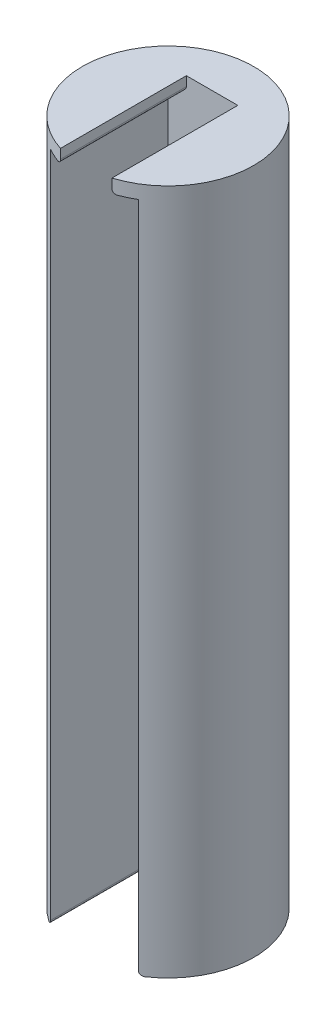
ISO-10303-21;
HEADER;
FILE_DESCRIPTION(('STEP AP214'),'2;1');
FILE_NAME('part.step','',(''),(''),'','','');
FILE_SCHEMA(('AUTOMOTIVE_DESIGN { 1 0 10303 214 1 1 1 1 }'));
ENDSEC;
DATA;
#1=APPLICATION_CONTEXT('core data for automotive mechanical design processes');
#2=APPLICATION_PROTOCOL_DEFINITION('international standard','automotive_design',2000,#1);
#3=PRODUCT_CONTEXT('',#1,'mechanical');
#4=PRODUCT('Part','Part','',(#3));
#5=PRODUCT_RELATED_PRODUCT_CATEGORY('part','',(#4));
#6=PRODUCT_DEFINITION_FORMATION('','',#4);
#7=PRODUCT_DEFINITION_CONTEXT('part definition',#1,'design');
#8=PRODUCT_DEFINITION('design','',#6,#7);
#9=PRODUCT_DEFINITION_SHAPE('','',#8);
#10=(LENGTH_UNIT() NAMED_UNIT(*) SI_UNIT(.MILLI.,.METRE.));
#11=(NAMED_UNIT(*) PLANE_ANGLE_UNIT() SI_UNIT($,.RADIAN.));
#12=(NAMED_UNIT(*) SI_UNIT($,.STERADIAN.) SOLID_ANGLE_UNIT());
#13=UNCERTAINTY_MEASURE_WITH_UNIT(LENGTH_MEASURE(1.E-05),#10,'distance_accuracy_value','');
#14=(GEOMETRIC_REPRESENTATION_CONTEXT(3) GLOBAL_UNCERTAINTY_ASSIGNED_CONTEXT((#13)) GLOBAL_UNIT_ASSIGNED_CONTEXT((#10,
#11,#12)) REPRESENTATION_CONTEXT('',''));
#15=CARTESIAN_POINT('',(0.,0.,0.));
#16=DIRECTION('',(0.,0.,1.));
#17=DIRECTION('',(1.,0.,0.));
#18=AXIS2_PLACEMENT_3D('',#15,#16,#17);
#19=CARTESIAN_POINT('',(0.,49.8,6.351));
#20=DIRECTION('',(0.,-1.,0.));
#21=DIRECTION('',(0.,0.,-1.));
#22=AXIS2_PLACEMENT_3D('',#19,#20,#21);
#23=PLANE('',#22);
#24=CARTESIAN_POINT('',(0.,49.8,0.));
#25=DIRECTION('',(0.,-1.,0.));
#26=DIRECTION('',(0.,0.,-1.));
#27=AXIS2_PLACEMENT_3D('',#24,#25,#26);
#28=CIRCLE('',#27,6.35);
#29=CARTESIAN_POINT('',(2.20499999999999,49.8,5.95486985584068));
#30=VERTEX_POINT('',#29);
#31=CARTESIAN_POINT('',(3.2639,49.8,5.44696766926333));
#32=VERTEX_POINT('',#31);
#33=EDGE_CURVE('E158',#30,#32,#28,.F.);
#34=ORIENTED_EDGE('',*,*,#33,.F.);
#35=DIRECTION('',(0.,0.,-1.));
#36=VECTOR('',#35,1.);
#37=CARTESIAN_POINT('',(2.20499999999999,49.8,-3.2639));
#38=LINE('',#37,#36);
#39=CARTESIAN_POINT('',(2.20499999999999,49.8,-3.2639));
#40=VERTEX_POINT('',#39);
#41=EDGE_CURVE('E283',#30,#40,#38,.T.);
#42=ORIENTED_EDGE('',*,*,#41,.T.);
#43=DIRECTION('',(-1.,0.,0.));
#44=VECTOR('',#43,1.);
#45=CARTESIAN_POINT('',(0.,49.8,-3.2639));
#46=LINE('',#45,#44);
#47=CARTESIAN_POINT('',(3.2639,49.8,-3.2639));
#48=VERTEX_POINT('',#47);
#49=EDGE_CURVE('E140',#48,#40,#46,.T.);
#50=ORIENTED_EDGE('',*,*,#49,.F.);
#51=DIRECTION('',(0.,0.,-1.));
#52=VECTOR('',#51,1.);
#53=CARTESIAN_POINT('',(3.2639,49.8,6.351));
#54=LINE('',#53,#52);
#55=EDGE_CURVE('E169',#32,#48,#54,.T.);
#56=ORIENTED_EDGE('',*,*,#55,.F.);
#57=EDGE_LOOP('',(#34,#42,#50,#56));
#58=FACE_BOUND('',#57,.T.);
#59=ADVANCED_FACE('F33',(#58),#23,.T.);
#60=CARTESIAN_POINT('',(1.90499999999854,0.,6.351));
#61=DIRECTION('',(1.,0.,0.));
#62=DIRECTION('',(0.,1.,0.));
#63=AXIS2_PLACEMENT_3D('',#60,#61,#62);
#64=PLANE('',#63);
#65=DIRECTION('',(0.,-1.,0.));
#66=VECTOR('',#65,1.);
#67=CARTESIAN_POINT('',(1.90499999999854,0.,-3.2639));
#68=LINE('',#67,#66);
#69=CARTESIAN_POINT('',(1.90500000000001,50.8,-3.2639));
#70=VERTEX_POINT('',#69);
#71=CARTESIAN_POINT('',(1.90499999999999,50.1,-3.2639));
#72=VERTEX_POINT('',#71);
#73=EDGE_CURVE('E124',#70,#72,#68,.T.);
#74=ORIENTED_EDGE('',*,*,#73,.T.);
#75=DIRECTION('',(0.,0.,-1.));
#76=VECTOR('',#75,1.);
#77=CARTESIAN_POINT('',(1.90499999999999,50.1,6.0575139289976));
#78=LINE('',#77,#76);
#79=CARTESIAN_POINT('',(1.90500000000001,50.1,6.0575139289976));
#80=VERTEX_POINT('',#79);
#81=EDGE_CURVE('E269',#72,#80,#78,.F.);
#82=ORIENTED_EDGE('',*,*,#81,.T.);
#83=DIRECTION('',(0.,-1.,0.));
#84=VECTOR('',#83,1.);
#85=CARTESIAN_POINT('',(1.90500000000001,50.7999999999999,6.0575139289976));
#86=LINE('',#85,#84);
#87=CARTESIAN_POINT('',(1.90500000000001,50.8,6.0575139289976));
#88=VERTEX_POINT('',#87);
#89=EDGE_CURVE('E127',#80,#88,#86,.F.);
#90=ORIENTED_EDGE('',*,*,#89,.T.);
#91=DIRECTION('',(0.,0.,-1.));
#92=VECTOR('',#91,1.);
#93=CARTESIAN_POINT('',(1.90500000000001,50.8,6.351));
#94=LINE('',#93,#92);
#95=EDGE_CURVE('E121',#88,#70,#94,.T.);
#96=ORIENTED_EDGE('',*,*,#95,.T.);
#97=EDGE_LOOP('',(#74,#82,#90,#96));
#98=FACE_BOUND('',#97,.T.);
#99=ADVANCED_FACE('F123',(#98),#64,.F.);
#100=CARTESIAN_POINT('',(-1.90500000000146,0.,6.351));
#101=DIRECTION('',(1.,0.,0.));
#102=DIRECTION('',(0.,1.,0.));
#103=AXIS2_PLACEMENT_3D('',#100,#101,#102);
#104=PLANE('',#103);
#105=DIRECTION('',(0.,-1.,0.));
#106=VECTOR('',#105,1.);
#107=CARTESIAN_POINT('',(-1.90499999999999,50.8000000000001,6.05751392899761));
#108=LINE('',#107,#106);
#109=CARTESIAN_POINT('',(-1.90499999999999,50.1,6.05751392899761));
#110=VERTEX_POINT('',#109);
#111=CARTESIAN_POINT('',(-1.90499999999999,50.8,6.05751392899761));
#112=VERTEX_POINT('',#111);
#113=EDGE_CURVE('E167',#110,#112,#108,.F.);
#114=ORIENTED_EDGE('',*,*,#113,.F.);
#115=DIRECTION('',(0.,0.,-1.));
#116=VECTOR('',#115,1.);
#117=CARTESIAN_POINT('',(-1.90500000000001,50.1,6.351));
#118=LINE('',#117,#116);
#119=CARTESIAN_POINT('',(-1.90500000000001,50.1,-3.2639));
#120=VERTEX_POINT('',#119);
#121=EDGE_CURVE('E264',#110,#120,#118,.T.);
#122=ORIENTED_EDGE('',*,*,#121,.T.);
#123=DIRECTION('',(0.,-1.,0.));
#124=VECTOR('',#123,1.);
#125=CARTESIAN_POINT('',(-1.90500000000146,0.,-3.2639));
#126=LINE('',#125,#124);
#127=CARTESIAN_POINT('',(-1.90499999999999,50.8,-3.2639));
#128=VERTEX_POINT('',#127);
#129=EDGE_CURVE('E144',#128,#120,#126,.T.);
#130=ORIENTED_EDGE('',*,*,#129,.F.);
#131=DIRECTION('',(0.,0.,-1.));
#132=VECTOR('',#131,1.);
#133=CARTESIAN_POINT('',(-1.90499999999999,50.8,6.351));
#134=LINE('',#133,#132);
#135=EDGE_CURVE('E133',#112,#128,#134,.T.);
#136=ORIENTED_EDGE('',*,*,#135,.F.);
#137=EDGE_LOOP('',(#114,#122,#130,#136));
#138=FACE_BOUND('',#137,.T.);
#139=ADVANCED_FACE('F243',(#138),#104,.T.);
#140=CARTESIAN_POINT('',(-2.20500000000001,49.8,-3.2639));
#141=VERTEX_POINT('',#140);
#142=CARTESIAN_POINT('',(-3.2639,49.8,-3.2639));
#143=VERTEX_POINT('',#142);
#144=EDGE_CURVE('E146',#141,#143,#46,.T.);
#145=ORIENTED_EDGE('',*,*,#144,.F.);
#146=DIRECTION('',(0.,0.,-1.));
#147=VECTOR('',#146,1.);
#148=CARTESIAN_POINT('',(-2.20500000000001,49.8,6.351));
#149=LINE('',#148,#147);
#150=CARTESIAN_POINT('',(-2.20500000000001,49.8,5.95486985584068));
#151=VERTEX_POINT('',#150);
#152=EDGE_CURVE('E259',#141,#151,#149,.F.);
#153=ORIENTED_EDGE('',*,*,#152,.T.);
#154=CARTESIAN_POINT('',(0.,49.8,0.));
#155=DIRECTION('',(0.,-1.,0.));
#156=DIRECTION('',(0.,0.,-1.));
#157=AXIS2_PLACEMENT_3D('',#154,#155,#156);
#158=CIRCLE('',#157,6.35);
#159=CARTESIAN_POINT('',(-3.2639,49.8,5.44696766926333));
#160=VERTEX_POINT('',#159);
#161=EDGE_CURVE('E164',#160,#151,#158,.F.);
#162=ORIENTED_EDGE('',*,*,#161,.F.);
#163=DIRECTION('',(0.,0.,-1.));
#164=VECTOR('',#163,1.);
#165=CARTESIAN_POINT('',(-3.2639,49.8,6.351));
#166=LINE('',#165,#164);
#167=EDGE_CURVE('E171',#160,#143,#166,.T.);
#168=ORIENTED_EDGE('',*,*,#167,.T.);
#169=EDGE_LOOP('',(#145,#153,#162,#168));
#170=FACE_BOUND('',#169,.T.);
#171=ADVANCED_FACE('F239',(#170),#23,.T.);
#172=CARTESIAN_POINT('',(-3.2639,0.,6.351));
#173=DIRECTION('',(1.,0.,0.));
#174=DIRECTION('',(0.,1.,0.));
#175=AXIS2_PLACEMENT_3D('',#172,#173,#174);
#176=PLANE('',#175);
#177=DIRECTION('',(0.,-1.,0.));
#178=VECTOR('',#177,1.);
#179=CARTESIAN_POINT('',(-3.2639,50.8,5.44696766926333));
#180=LINE('',#179,#178);
#181=CARTESIAN_POINT('',(-3.2639,0.300000000000002,5.44696766926333));
#182=VERTEX_POINT('',#181);
#183=EDGE_CURVE('E162',#182,#160,#180,.F.);
#184=ORIENTED_EDGE('',*,*,#183,.F.);
#185=DIRECTION('',(0.,0.,-1.));
#186=VECTOR('',#185,1.);
#187=CARTESIAN_POINT('',(-3.2639,0.3,-3.2639));
#188=LINE('',#187,#186);
#189=CARTESIAN_POINT('',(-3.2639,0.3,-3.2639));
#190=VERTEX_POINT('',#189);
#191=EDGE_CURVE('E179',#182,#190,#188,.T.);
#192=ORIENTED_EDGE('',*,*,#191,.T.);
#193=DIRECTION('',(0.,-1.,0.));
#194=VECTOR('',#193,1.);
#195=CARTESIAN_POINT('',(-3.2639,0.,-3.2639));
#196=LINE('',#195,#194);
#197=EDGE_CURVE('E150',#143,#190,#196,.T.);
#198=ORIENTED_EDGE('',*,*,#197,.F.);
#199=ORIENTED_EDGE('',*,*,#167,.F.);
#200=EDGE_LOOP('',(#184,#192,#198,#199));
#201=FACE_BOUND('',#200,.T.);
#202=ADVANCED_FACE('F249',(#201),#176,.T.);
#203=CARTESIAN_POINT('',(3.2639,0.,6.351));
#204=DIRECTION('',(1.,0.,0.));
#205=DIRECTION('',(0.,1.,0.));
#206=AXIS2_PLACEMENT_3D('',#203,#204,#205);
#207=PLANE('',#206);
#208=DIRECTION('',(0.,-1.,0.));
#209=VECTOR('',#208,1.);
#210=CARTESIAN_POINT('',(3.2639,0.,-3.2639));
#211=LINE('',#210,#209);
#212=CARTESIAN_POINT('',(3.2639,0.3,-3.2639));
#213=VERTEX_POINT('',#212);
#214=EDGE_CURVE('E155',#48,#213,#211,.T.);
#215=ORIENTED_EDGE('',*,*,#214,.T.);
#216=DIRECTION('',(0.,0.,-1.));
#217=VECTOR('',#216,1.);
#218=CARTESIAN_POINT('',(3.2639,0.3,6.351));
#219=LINE('',#218,#217);
#220=CARTESIAN_POINT('',(3.2639,0.300000000000002,5.44696766926333));
#221=VERTEX_POINT('',#220);
#222=EDGE_CURVE('E279',#213,#221,#219,.F.);
#223=ORIENTED_EDGE('',*,*,#222,.T.);
#224=DIRECTION('',(0.,-1.,0.));
#225=VECTOR('',#224,1.);
#226=CARTESIAN_POINT('',(3.2639,50.8,5.44696766926333));
#227=LINE('',#226,#225);
#228=EDGE_CURVE('E132',#221,#32,#227,.F.);
#229=ORIENTED_EDGE('',*,*,#228,.T.);
#230=ORIENTED_EDGE('',*,*,#55,.T.);
#231=EDGE_LOOP('',(#215,#223,#229,#230));
#232=FACE_BOUND('',#231,.T.);
#233=ADVANCED_FACE('F255',(#232),#207,.F.);
#234=CARTESIAN_POINT('',(0.,0.,-3.2639));
#235=DIRECTION('',(0.,0.,1.));
#236=DIRECTION('',(1.,0.,0.));
#237=AXIS2_PLACEMENT_3D('',#234,#235,#236);
#238=PLANE('',#237);
#239=ORIENTED_EDGE('',*,*,#49,.T.);
#240=CARTESIAN_POINT('',(2.20499999999999,50.1,-3.2639));
#241=DIRECTION('',(0.,0.,1.));
#242=DIRECTION('',(1.,0.,0.));
#243=AXIS2_PLACEMENT_3D('',#240,#241,#242);
#244=CIRCLE('',#243,0.3);
#245=EDGE_CURVE('E42',#40,#72,#244,.F.);
#246=ORIENTED_EDGE('',*,*,#245,.T.);
#247=ORIENTED_EDGE('',*,*,#73,.F.);
#248=DIRECTION('',(-1.,0.,0.));
#249=VECTOR('',#248,1.);
#250=CARTESIAN_POINT('',(0.,50.8,-3.2639));
#251=LINE('',#250,#249);
#252=EDGE_CURVE('E138',#70,#128,#251,.T.);
#253=ORIENTED_EDGE('',*,*,#252,.T.);
#254=ORIENTED_EDGE('',*,*,#129,.T.);
#255=CARTESIAN_POINT('',(-2.20500000000001,50.1,-3.2639));
#256=DIRECTION('',(0.,0.,1.));
#257=DIRECTION('',(1.,0.,0.));
#258=AXIS2_PLACEMENT_3D('',#255,#256,#257);
#259=CIRCLE('',#258,0.3);
#260=EDGE_CURVE('E11',#120,#141,#259,.F.);
#261=ORIENTED_EDGE('',*,*,#260,.T.);
#262=ORIENTED_EDGE('',*,*,#144,.T.);
#263=ORIENTED_EDGE('',*,*,#197,.T.);
#264=CARTESIAN_POINT('',(-3.5639,0.3,-3.2639));
#265=DIRECTION('',(0.,0.,1.));
#266=DIRECTION('',(1.,0.,0.));
#267=AXIS2_PLACEMENT_3D('',#264,#265,#266);
#268=CIRCLE('',#267,0.3);
#269=CARTESIAN_POINT('',(-3.5639,0.,-3.2639));
#270=VERTEX_POINT('',#269);
#271=EDGE_CURVE('E263',#190,#270,#268,.F.);
#272=ORIENTED_EDGE('',*,*,#271,.T.);
#273=DIRECTION('',(-1.,0.,0.));
#274=VECTOR('',#273,1.);
#275=CARTESIAN_POINT('',(0.,0.,-3.2639));
#276=LINE('',#275,#274);
#277=CARTESIAN_POINT('',(3.5639,0.,-3.2639));
#278=VERTEX_POINT('',#277);
#279=EDGE_CURVE('E153',#278,#270,#276,.T.);
#280=ORIENTED_EDGE('',*,*,#279,.F.);
#281=CARTESIAN_POINT('',(3.5639,0.3,-3.2639));
#282=DIRECTION('',(0.,0.,1.));
#283=DIRECTION('',(1.,0.,0.));
#284=AXIS2_PLACEMENT_3D('',#281,#282,#283);
#285=CIRCLE('',#284,0.3);
#286=EDGE_CURVE('E267',#278,#213,#285,.F.);
#287=ORIENTED_EDGE('',*,*,#286,.T.);
#288=ORIENTED_EDGE('',*,*,#214,.F.);
#289=EDGE_LOOP('',(#239,#246,#247,#253,#254,#261,#262,#263,#272,#280,#287,#288));
#290=FACE_BOUND('',#289,.T.);
#291=ADVANCED_FACE('F137',(#290),#238,.T.);
#292=CARTESIAN_POINT('',(0.,50.8,0.));
#293=DIRECTION('',(0.,-1.,0.));
#294=DIRECTION('',(0.,0.,-1.));
#295=AXIS2_PLACEMENT_3D('',#292,#293,#294);
#296=CYLINDRICAL_SURFACE('',#295,6.35);
#297=CARTESIAN_POINT('',(0.,0.,0.));
#298=DIRECTION('',(0.,1.,0.));
#299=DIRECTION('',(0.,0.,1.));
#300=AXIS2_PLACEMENT_3D('',#297,#298,#299);
#301=CIRCLE('',#300,6.35);
#302=CARTESIAN_POINT('',(3.5639,0.,5.25557958649662));
#303=VERTEX_POINT('',#302);
#304=CARTESIAN_POINT('',(-3.5639,0.,5.25557958649662));
#305=VERTEX_POINT('',#304);
#306=EDGE_CURVE('E176',#303,#305,#301,.T.);
#307=ORIENTED_EDGE('',*,*,#306,.T.);
#308=CARTESIAN_POINT('',(-3.5639,0.,5.25557958649662));
#309=CARTESIAN_POINT('',(-3.54283089153724,-6.1987585318716E-06,5.26987679990586));
#310=CARTESIAN_POINT('',(-3.52160957300464,0.00222242994010891,5.28407272544586));
#311=CARTESIAN_POINT('',(-3.47961248427518,0.0112811686565466,5.31181749122978));
#312=CARTESIAN_POINT('',(-3.4588389399359,0.0181304200412257,5.32536338762216));
#313=CARTESIAN_POINT('',(-3.42325231335275,0.0344642492382223,5.34828855052961));
#314=CARTESIAN_POINT('',(-3.40815958393852,0.0429928297112837,5.35791395567906));
#315=CARTESIAN_POINT('',(-3.37930428393905,0.0628702265723753,5.37615956044802));
#316=CARTESIAN_POINT('',(-3.36553944304108,0.0742141065133639,5.38478148114779));
#317=CARTESIAN_POINT('',(-3.33978342696808,0.0997423569453787,5.40079431415393));
#318=CARTESIAN_POINT('',(-3.32780767830042,0.113949199463051,5.40817458203768));
#319=CARTESIAN_POINT('',(-3.30643272000371,0.144877940734812,5.4212692789451));
#320=CARTESIAN_POINT('',(-3.29703272060343,0.161599066123487,5.42698421862263));
#321=CARTESIAN_POINT('',(-3.28258073927808,0.194477048206266,5.43573589761963));
#322=CARTESIAN_POINT('',(-3.27710023079062,0.210375240524369,5.43903811379768));
#323=CARTESIAN_POINT('',(-3.26887141072188,0.243078612872876,5.44398790255518));
#324=CARTESIAN_POINT('',(-3.2661150143908,0.25988095206193,5.44564037148268));
#325=CARTESIAN_POINT('',(-3.26419710888639,0.28452714830997,5.44678950485321));
#326=CARTESIAN_POINT('',(-3.26389531678946,0.292266014361477,5.44697013085243));
#327=CARTESIAN_POINT('',(-3.2639,0.3,5.44696766926333));
#328=B_SPLINE_CURVE_WITH_KNOTS('',3,(#308,#309,#310,#311,#312,#313,#314,#315,#316,#317,#318,
#319,#320,#321,#322,#323,#324,#325,#326,#327),.UNSPECIFIED.,.F.,.F.,(4,2,2,2,2,2,2,2,2,4),(0.,
0.0764056356164394,0.153129748410931,0.212372871033852,0.271512839625025,0.331136480942316,
0.390741820065753,0.441860079231075,0.492826167466519,0.516034003711905),.UNSPECIFIED.);
#329=EDGE_CURVE('E219',#305,#182,#328,.T.);
#330=ORIENTED_EDGE('',*,*,#329,.T.);
#331=ORIENTED_EDGE('',*,*,#183,.T.);
#332=ORIENTED_EDGE('',*,*,#161,.T.);
#333=CARTESIAN_POINT('',(-2.20500000000001,49.8,5.95486985584068));
#334=CARTESIAN_POINT('',(-2.18749648412347,49.7999884736114,5.96135458565457));
#335=CARTESIAN_POINT('',(-2.16995562296787,49.8015316749422,5.96775859511687));
#336=CARTESIAN_POINT('',(-2.13527681540212,49.80768600154,5.9802526880081));
#337=CARTESIAN_POINT('',(-2.11813949933474,49.8123016343588,5.98634229601454));
#338=CARTESIAN_POINT('',(-2.08477491964853,49.8245682173805,5.9980438124385));
#339=CARTESIAN_POINT('',(-2.06854905378703,49.8322236916929,6.00365499363846));
#340=CARTESIAN_POINT('',(-2.03758254474624,49.8504137706086,6.01423514141777));
#341=CARTESIAN_POINT('',(-2.02284055567006,49.8609457333989,6.019204691144));
#342=CARTESIAN_POINT('',(-1.99589078659269,49.8841814070103,6.0281933122617));
#343=CARTESIAN_POINT('',(-1.98360725894704,49.8967858264825,6.0322416239047));
#344=CARTESIAN_POINT('',(-1.96134116322248,49.9241006945833,6.03951806333613));
#345=CARTESIAN_POINT('',(-1.95135878571439,49.9388113174747,6.04274612319728));
#346=CARTESIAN_POINT('',(-1.93455780537608,49.9690629490618,6.0481451773814));
#347=CARTESIAN_POINT('',(-1.92759881628944,49.984517774452,6.05036338209071));
#348=CARTESIAN_POINT('',(-1.91637094757207,50.0164601819506,6.05392909869947));
#349=CARTESIAN_POINT('',(-1.91209851314297,50.0329463674704,6.05527776122088));
#350=CARTESIAN_POINT('',(-1.90783595782906,50.057989262952,6.05662149004383));
#351=CARTESIAN_POINT('',(-1.90677280652006,50.0663590224215,6.05695618957622));
#352=CARTESIAN_POINT('',(-1.90535532515586,50.0831510830318,6.0574021967304));
#353=CARTESIAN_POINT('',(-1.90499989167758,50.0915732818111,6.05751385210757));
#354=CARTESIAN_POINT('',(-1.90499999999989,50.1,6.05751392899783));
#355=B_SPLINE_CURVE_WITH_KNOTS('',3,(#333,#334,#335,#336,#337,#338,#339,#340,#341,#342,#343,
#344,#345,#346,#347,#348,#349,#350,#351,#352,#353,#354),.UNSPECIFIED.,.F.,.F.,(4,2,2,2,2,2,2,2,
2,2,4),(0.,0.0559459503225442,0.111974160154928,0.168086069596433,0.224146617255697,
0.2780475549639,0.331952954901276,0.38298222061995,0.43394382250568,0.459246308081713,
0.484509312842986),.UNSPECIFIED.);
#356=EDGE_CURVE('E189',#151,#110,#355,.T.);
#357=ORIENTED_EDGE('',*,*,#356,.T.);
#358=ORIENTED_EDGE('',*,*,#113,.T.);
#359=CARTESIAN_POINT('',(0.,50.8,0.));
#360=DIRECTION('',(0.,1.,0.));
#361=DIRECTION('',(0.,0.,1.));
#362=AXIS2_PLACEMENT_3D('',#359,#360,#361);
#363=CIRCLE('',#362,6.35);
#364=EDGE_CURVE('E177',#88,#112,#363,.T.);
#365=ORIENTED_EDGE('',*,*,#364,.F.);
#366=ORIENTED_EDGE('',*,*,#89,.F.);
#367=CARTESIAN_POINT('',(1.90499999999999,50.1,6.0575139289976));
#368=CARTESIAN_POINT('',(1.90498323319517,50.0837101997053,6.0575173250332));
#369=CARTESIAN_POINT('',(1.90632568224043,50.0674285405525,6.05709700122984));
#370=CARTESIAN_POINT('',(1.91160094664823,50.0353647985122,6.05543519807063));
#371=CARTESIAN_POINT('',(1.91552872705752,50.0195818069526,6.05419531479355));
#372=CARTESIAN_POINT('',(1.925847973988,49.9889304805598,6.05092034100683));
#373=CARTESIAN_POINT('',(1.93223967303458,49.9740622322064,6.04888517544441));
#374=CARTESIAN_POINT('',(1.94725993023185,49.945635557596,6.04406660793537));
#375=CARTESIAN_POINT('',(1.95588880461077,49.9320773168827,6.04128310020736));
#376=CARTESIAN_POINT('',(1.97526881251586,49.9063842318257,6.03497459017313));
#377=CARTESIAN_POINT('',(1.98605434222702,49.8942783441412,6.0314374998119));
#378=CARTESIAN_POINT('',(2.00930671461745,49.8720460318468,6.02373110230299));
#379=CARTESIAN_POINT('',(2.02177388382672,49.861919992609,6.01956167235205));
#380=CARTESIAN_POINT('',(2.04860129150724,49.8434534119611,6.01048596969333));
#381=CARTESIAN_POINT('',(2.06302061646036,49.8352107943532,6.00555538142895));
#382=CARTESIAN_POINT('',(2.0928781218186,49.821252133441,5.99521566370403));
#383=CARTESIAN_POINT('',(2.1083165966315,49.8155368239181,5.98980639580949));
#384=CARTESIAN_POINT('',(2.13728680966688,49.8074185655786,5.97952353490276));
#385=CARTESIAN_POINT('',(2.15073170914511,49.8046335847609,5.97470140679683));
#386=CARTESIAN_POINT('',(2.17779046314746,49.8009243552305,5.96489221242406));
#387=CARTESIAN_POINT('',(2.19140398769293,49.7999969177338,5.95990544377971));
#388=CARTESIAN_POINT('',(2.20499999999999,49.8,5.95486985584068));
#389=B_SPLINE_CURVE_WITH_KNOTS('',3,(#367,#368,#369,#370,#371,#372,#373,#374,#375,#376,#377,
#378,#379,#380,#381,#382,#383,#384,#385,#386,#387,#388),.UNSPECIFIED.,.F.,.F.,(4,2,2,2,2,2,2,2,
2,2,4),(0.,0.0487963703222471,0.0974979893919861,0.14620420566572,0.194917310396414,
0.24448019872142,0.294052724741978,0.345801956231203,0.397566202799998,0.441104939819583,
0.484568871027594),.UNSPECIFIED.);
#390=EDGE_CURVE('E195',#80,#30,#389,.T.);
#391=ORIENTED_EDGE('',*,*,#390,.T.);
#392=ORIENTED_EDGE('',*,*,#33,.T.);
#393=ORIENTED_EDGE('',*,*,#228,.F.);
#394=CARTESIAN_POINT('',(3.2639,0.3,5.44696766926333));
#395=CARTESIAN_POINT('',(3.26387980415929,0.284879247138558,5.44697794370052));
#396=CARTESIAN_POINT('',(3.26504175733107,0.269775231695065,5.44628351603548));
#397=CARTESIAN_POINT('',(3.26956739341236,0.24008792988383,5.44356878793497));
#398=CARTESIAN_POINT('',(3.27292151854544,0.225502671501911,5.44155424305459));
#399=CARTESIAN_POINT('',(3.28166785842854,0.197213431633605,5.43628369019979));
#400=CARTESIAN_POINT('',(3.28705840502031,0.183508739543748,5.4330286983328));
#401=CARTESIAN_POINT('',(3.29962607631008,0.157273214074533,5.42540523810505));
#402=CARTESIAN_POINT('',(3.30680470381642,0.144743380370209,5.42103583305156));
#403=CARTESIAN_POINT('',(3.32306158829708,0.120499179356199,5.411086448554));
#404=CARTESIAN_POINT('',(3.33221716718842,0.108857413793699,5.40545667599321));
#405=CARTESIAN_POINT('',(3.35184679853037,0.0872882412669955,5.39330662830595));
#406=CARTESIAN_POINT('',(3.36232099070869,0.0773610162499913,5.38678625880057));
#407=CARTESIAN_POINT('',(3.38574703019003,0.0580884337371905,5.37209754935191));
#408=CARTESIAN_POINT('',(3.39884296596858,0.0489977297874437,5.36382541441397));
#409=CARTESIAN_POINT('',(3.42594934647107,0.0331351610826755,5.34655319219363));
#410=CARTESIAN_POINT('',(3.43996124236264,0.02636708756327,5.33755194409596));
#411=CARTESIAN_POINT('',(3.47204381737548,0.0137698447145048,5.3167524201964));
#412=CARTESIAN_POINT('',(3.49026914458213,0.00857497112847409,5.3048084195586));
#413=CARTESIAN_POINT('',(3.52699757380311,0.00169424514090843,5.28046284348591));
#414=CARTESIAN_POINT('',(3.54549967303139,-2.13635198836004E-06,5.26806275569723));
#415=CARTESIAN_POINT('',(3.5639,0.,5.25557958649662));
#416=B_SPLINE_CURVE_WITH_KNOTS('',3,(#394,#395,#396,#397,#398,#399,#400,#401,#402,#403,#404,
#405,#406,#407,#408,#409,#410,#411,#412,#413,#414,#415),.UNSPECIFIED.,.F.,.F.,(4,2,2,2,2,2,2,2,
2,2,4),(0.,0.0452755077471444,0.0903549213432736,0.135397487406787,0.180478038386503,
0.22782358170292,0.275174146249698,0.328846725188127,0.382606501881309,0.449512271667487,
0.516216385678936),.UNSPECIFIED.);
#417=EDGE_CURVE('E215',#221,#303,#416,.T.);
#418=ORIENTED_EDGE('',*,*,#417,.T.);
#419=EDGE_LOOP('',(#307,#330,#331,#332,#357,#358,#365,#366,#391,#392,#393,#418));
#420=FACE_BOUND('',#419,.T.);
#421=ADVANCED_FACE('F200',(#420),#296,.T.);
#422=CARTESIAN_POINT('',(0.,0.,0.));
#423=DIRECTION('',(0.,1.,0.));
#424=DIRECTION('',(0.,0.,1.));
#425=AXIS2_PLACEMENT_3D('',#422,#423,#424);
#426=PLANE('',#425);
#427=ORIENTED_EDGE('',*,*,#279,.T.);
#428=DIRECTION('',(0.,0.,-1.));
#429=VECTOR('',#428,1.);
#430=CARTESIAN_POINT('',(-3.5639,0.,5.44696766926333));
#431=LINE('',#430,#429);
#432=EDGE_CURVE('E187',#270,#305,#431,.F.);
#433=ORIENTED_EDGE('',*,*,#432,.T.);
#434=ORIENTED_EDGE('',*,*,#306,.F.);
#435=DIRECTION('',(0.,0.,-1.));
#436=VECTOR('',#435,1.);
#437=CARTESIAN_POINT('',(3.5639,0.,0.));
#438=LINE('',#437,#436);
#439=EDGE_CURVE('E184',#303,#278,#438,.T.);
#440=ORIENTED_EDGE('',*,*,#439,.T.);
#441=EDGE_LOOP('',(#427,#433,#434,#440));
#442=FACE_BOUND('',#441,.T.);
#443=ADVANCED_FACE('F205',(#442),#426,.F.);
#444=CARTESIAN_POINT('',(0.,50.8,0.));
#445=DIRECTION('',(0.,1.,0.));
#446=DIRECTION('',(0.,0.,1.));
#447=AXIS2_PLACEMENT_3D('',#444,#445,#446);
#448=PLANE('',#447);
#449=ORIENTED_EDGE('',*,*,#95,.F.);
#450=ORIENTED_EDGE('',*,*,#364,.T.);
#451=ORIENTED_EDGE('',*,*,#135,.T.);
#452=ORIENTED_EDGE('',*,*,#252,.F.);
#453=EDGE_LOOP('',(#449,#450,#451,#452));
#454=FACE_BOUND('',#453,.T.);
#455=ADVANCED_FACE('F142',(#454),#448,.T.);
#456=CARTESIAN_POINT('',(-3.5639,0.3,6.351));
#457=DIRECTION('',(0.,0.,1.));
#458=DIRECTION('',(1.,0.,0.));
#459=AXIS2_PLACEMENT_3D('',#456,#457,#458);
#460=CYLINDRICAL_SURFACE('',#459,0.3);
#461=ORIENTED_EDGE('',*,*,#329,.F.);
#462=ORIENTED_EDGE('',*,*,#432,.F.);
#463=ORIENTED_EDGE('',*,*,#271,.F.);
#464=ORIENTED_EDGE('',*,*,#191,.F.);
#465=EDGE_LOOP('',(#461,#462,#463,#464));
#466=FACE_BOUND('',#465,.T.);
#467=ADVANCED_FACE('F208',(#466),#460,.T.);
#468=CARTESIAN_POINT('',(3.5639,0.3,0.));
#469=DIRECTION('',(0.,0.,-1.));
#470=DIRECTION('',(-1.,0.,0.));
#471=AXIS2_PLACEMENT_3D('',#468,#469,#470);
#472=CYLINDRICAL_SURFACE('',#471,0.3);
#473=ORIENTED_EDGE('',*,*,#417,.F.);
#474=ORIENTED_EDGE('',*,*,#222,.F.);
#475=ORIENTED_EDGE('',*,*,#286,.F.);
#476=ORIENTED_EDGE('',*,*,#439,.F.);
#477=EDGE_LOOP('',(#473,#474,#475,#476));
#478=FACE_BOUND('',#477,.T.);
#479=ADVANCED_FACE('F224',(#478),#472,.T.);
#480=CARTESIAN_POINT('',(2.20499999999999,50.1,6.351));
#481=DIRECTION('',(0.,0.,1.));
#482=DIRECTION('',(1.,0.,0.));
#483=AXIS2_PLACEMENT_3D('',#480,#481,#482);
#484=CYLINDRICAL_SURFACE('',#483,0.3);
#485=ORIENTED_EDGE('',*,*,#390,.F.);
#486=ORIENTED_EDGE('',*,*,#81,.F.);
#487=ORIENTED_EDGE('',*,*,#245,.F.);
#488=ORIENTED_EDGE('',*,*,#41,.F.);
#489=EDGE_LOOP('',(#485,#486,#487,#488));
#490=FACE_BOUND('',#489,.T.);
#491=ADVANCED_FACE('F227',(#490),#484,.T.);
#492=CARTESIAN_POINT('',(-2.20500000000001,50.1,6.351));
#493=DIRECTION('',(0.,0.,-1.));
#494=DIRECTION('',(-1.,0.,0.));
#495=AXIS2_PLACEMENT_3D('',#492,#493,#494);
#496=CYLINDRICAL_SURFACE('',#495,0.3);
#497=ORIENTED_EDGE('',*,*,#356,.F.);
#498=ORIENTED_EDGE('',*,*,#152,.F.);
#499=ORIENTED_EDGE('',*,*,#260,.F.);
#500=ORIENTED_EDGE('',*,*,#121,.F.);
#501=EDGE_LOOP('',(#497,#498,#499,#500));
#502=FACE_BOUND('',#501,.T.);
#503=ADVANCED_FACE('F35',(#502),#496,.T.);
#504=CLOSED_SHELL('',(#59,#99,#139,#171,#202,#233,#291,#421,#443,#455,#467,#479,#491,#503));
#505=MANIFOLD_SOLID_BREP('B2',#504);
#506=ADVANCED_BREP_SHAPE_REPRESENTATION('',(#18,#505),#14);
#507=SHAPE_DEFINITION_REPRESENTATION(#9,#506);
ENDSEC;
END-ISO-10303-21;
